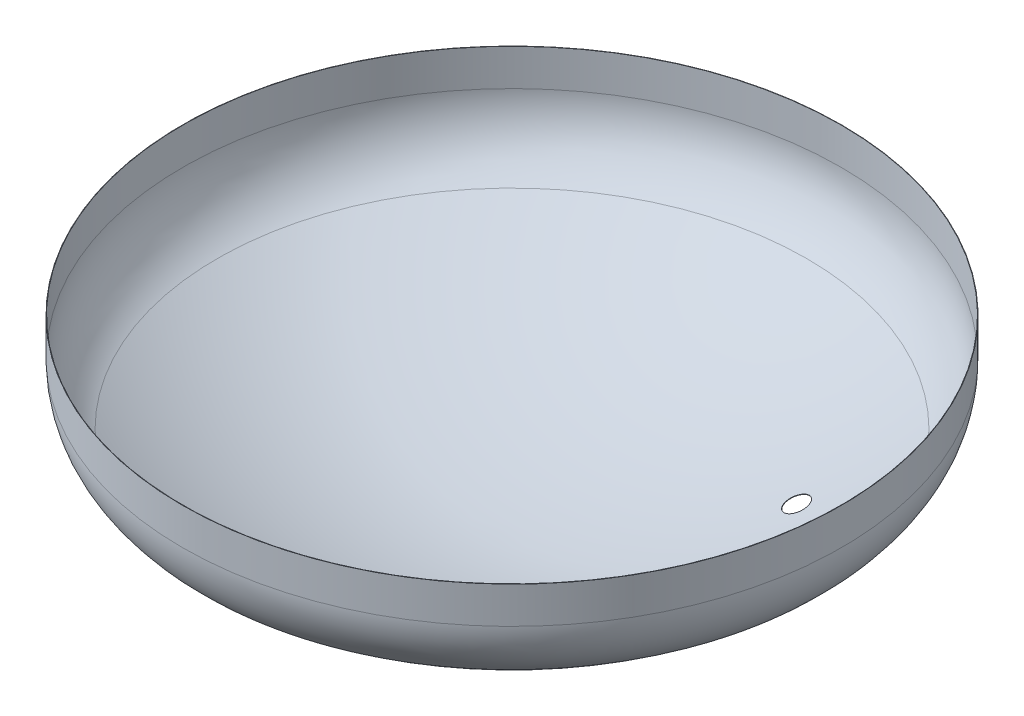
ISO-10303-21;
HEADER;
FILE_DESCRIPTION(('STEP AP214'),'2;1');
FILE_NAME('part.step','',(''),(''),'','','');
FILE_SCHEMA(('AUTOMOTIVE_DESIGN { 1 0 10303 214 1 1 1 1 }'));
ENDSEC;
DATA;
#1=APPLICATION_CONTEXT('core data for automotive mechanical design processes');
#2=APPLICATION_PROTOCOL_DEFINITION('international standard','automotive_design',2000,#1);
#3=PRODUCT_CONTEXT('',#1,'mechanical');
#4=PRODUCT('Part','Part','',(#3));
#5=PRODUCT_RELATED_PRODUCT_CATEGORY('part','',(#4));
#6=PRODUCT_DEFINITION_FORMATION('','',#4);
#7=PRODUCT_DEFINITION_CONTEXT('part definition',#1,'design');
#8=PRODUCT_DEFINITION('design','',#6,#7);
#9=PRODUCT_DEFINITION_SHAPE('','',#8);
#10=(LENGTH_UNIT() NAMED_UNIT(*) SI_UNIT(.MILLI.,.METRE.));
#11=(NAMED_UNIT(*) PLANE_ANGLE_UNIT() SI_UNIT($,.RADIAN.));
#12=(NAMED_UNIT(*) SI_UNIT($,.STERADIAN.) SOLID_ANGLE_UNIT());
#13=UNCERTAINTY_MEASURE_WITH_UNIT(LENGTH_MEASURE(1.E-05),#10,'distance_accuracy_value','');
#14=(GEOMETRIC_REPRESENTATION_CONTEXT(3) GLOBAL_UNCERTAINTY_ASSIGNED_CONTEXT((#13)) GLOBAL_UNIT_ASSIGNED_CONTEXT((#10,
#11,#12)) REPRESENTATION_CONTEXT('',''));
#15=CARTESIAN_POINT('',(0.,0.,0.));
#16=DIRECTION('',(0.,0.,1.));
#17=DIRECTION('',(1.,0.,0.));
#18=AXIS2_PLACEMENT_3D('',#15,#16,#17);
#19=CARTESIAN_POINT('',(0.,2225.,0.));
#20=DIRECTION('',(0.,-1.,0.));
#21=DIRECTION('',(1.,0.,0.));
#22=AXIS2_PLACEMENT_3D('',#19,#20,#21);
#23=SPHERICAL_SURFACE('',#22,1524.);
#24=CARTESIAN_POINT('',(476.976413862682,892.724049239016,564.932997480776));
#25=DIRECTION('',(-0.313041418963689,0.8743777301271,-0.370767656452097));
#26=DIRECTION('',(0.,0.390388802704132,0.920650087016362));
#27=AXIS2_PLACEMENT_3D('',#24,#25,#26);
#28=CIRCLE('',#27,30.9999999999999);
#29=CARTESIAN_POINT('',(476.976413862682,904.826102122845,593.473150178283));
#30=VERTEX_POINT('',#29);
#31=EDGE_CURVE('E115',#30,#30,#28,.T.);
#32=ORIENTED_EDGE('',*,*,#31,.F.);
#33=EDGE_LOOP('',(#32));
#34=FACE_BOUND('',#33,.T.);
#35=CARTESIAN_POINT('',(739.361745713097,892.724049239016,0.));
#36=DIRECTION('',(-0.485245901639344,0.8743777301271,0.));
#37=DIRECTION('',(-0.8743777301271,-0.485245901639344,0.));
#38=AXIS2_PLACEMENT_3D('',#35,#36,#37);
#39=CIRCLE('',#38,30.9999999999999);
#40=CARTESIAN_POINT('',(712.256036079157,877.681426288197,0.));
#41=VERTEX_POINT('',#40);
#42=EDGE_CURVE('E108',#41,#41,#39,.T.);
#43=ORIENTED_EDGE('',*,*,#42,.F.);
#44=EDGE_LOOP('',(#43));
#45=FACE_BOUND('',#44,.T.);
#46=CARTESIAN_POINT('',(441.031015003651,805.802650245905,-336.133197193915));
#47=DIRECTION('',(-0.289450318152389,0.931424572042739,0.220605484783316));
#48=DIRECTION('',(-0.954951597896464,-0.296761597372353,0.));
#49=AXIS2_PLACEMENT_3D('',#46,#47,#48);
#50=CIRCLE('',#49,30.9999999999999);
#51=CARTESIAN_POINT('',(411.427515468861,796.603040727362,-336.133197193915));
#52=VERTEX_POINT('',#51);
#53=EDGE_CURVE('E101',#52,#52,#50,.T.);
#54=ORIENTED_EDGE('',*,*,#53,.F.);
#55=EDGE_LOOP('',(#54));
#56=FACE_BOUND('',#55,.T.);
#57=CARTESIAN_POINT('',(554.521309284823,805.802650245905,0.));
#58=DIRECTION('',(-0.363934426229508,0.931424572042739,0.));
#59=DIRECTION('',(-0.931424572042739,-0.363934426229508,0.));
#60=AXIS2_PLACEMENT_3D('',#57,#58,#59);
#61=CIRCLE('',#60,30.9999999999999);
#62=CARTESIAN_POINT('',(525.647147551498,794.52068303279,0.));
#63=VERTEX_POINT('',#62);
#64=EDGE_CURVE('E94',#63,#63,#61,.T.);
#65=ORIENTED_EDGE('',*,*,#64,.F.);
#66=EDGE_LOOP('',(#65));
#67=FACE_BOUND('',#66,.T.);
#68=CARTESIAN_POINT('',(695.615997398622,892.724049239016,250.547750313266));
#69=DIRECTION('',(-0.456535402067484,0.8743777301271,-0.164435433276591));
#70=DIRECTION('',(-0.886444141805444,-0.462835590095242,0.));
#71=AXIS2_PLACEMENT_3D('',#68,#69,#70);
#72=CIRCLE('',#71,30.9999999999999);
#73=CARTESIAN_POINT('',(668.136229002653,878.376145946064,250.547750313266));
#74=VERTEX_POINT('',#73);
#75=EDGE_CURVE('E86',#74,#74,#72,.T.);
#76=ORIENTED_EDGE('',*,*,#75,.F.);
#77=EDGE_LOOP('',(#76));
#78=FACE_BOUND('',#77,.T.);
#79=CARTESIAN_POINT('',(450.811326739237,805.802650245905,322.897863316813));
#80=DIRECTION('',(-0.295869173623294,0.931424572042739,-0.211919085253005));
#81=DIRECTION('',(-0.953071479298859,-0.302745363873807,0.));
#82=AXIS2_PLACEMENT_3D('',#79,#80,#81);
#83=CIRCLE('',#82,31.);
#84=CARTESIAN_POINT('',(421.266110880972,796.417543965817,322.897863316813));
#85=VERTEX_POINT('',#84);
#86=EDGE_CURVE('E79',#85,#85,#83,.T.);
#87=ORIENTED_EDGE('',*,*,#86,.F.);
#88=EDGE_LOOP('',(#87));
#89=FACE_BOUND('',#88,.T.);
#90=CARTESIAN_POINT('',(691.061644829552,892.724049239016,-262.848994803846));
#91=DIRECTION('',(-0.453546363303205,0.8743777301271,0.172508786420336));
#92=DIRECTION('',(-0.88768593636519,-0.460449430860172,0.));
#93=AXIS2_PLACEMENT_3D('',#90,#91,#92);
#94=CIRCLE('',#93,30.9999999999999);
#95=CARTESIAN_POINT('',(663.543380802231,878.450116882351,-262.848994803846));
#96=VERTEX_POINT('',#95);
#97=EDGE_CURVE('E72',#96,#96,#94,.T.);
#98=ORIENTED_EDGE('',*,*,#97,.F.);
#99=EDGE_LOOP('',(#98));
#100=FACE_BOUND('',#99,.T.);
#101=CARTESIAN_POINT('',(0.,931.037735849056,0.));
#102=DIRECTION('',(0.,-1.,0.));
#103=DIRECTION('',(0.,0.,-1.));
#104=AXIS2_PLACEMENT_3D('',#101,#102,#103);
#105=CIRCLE('',#104,805.132075471697);
#106=CARTESIAN_POINT('',(0.,931.037735849056,-805.132075471697));
#107=VERTEX_POINT('',#106);
#108=EDGE_CURVE('E65',#107,#107,#105,.T.);
#109=ORIENTED_EDGE('',*,*,#108,.F.);
#110=EDGE_LOOP('',(#109));
#111=FACE_BOUND('',#110,.T.);
#112=ADVANCED_FACE('F37',(#34,#45,#56,#67,#78,#89,#100,#111),#23,.F.);
#113=CARTESIAN_POINT('',(0.,2225.,0.));
#114=DIRECTION('',(0.,-1.,0.));
#115=DIRECTION('',(1.,0.,0.));
#116=AXIS2_PLACEMENT_3D('',#113,#114,#115);
#117=SPHERICAL_SURFACE('',#116,1525.);
#118=CARTESIAN_POINT('',(477.289520022003,891.8494906781,565.303841815997));
#119=DIRECTION('',(-0.313041418963689,0.8743777301271,-0.370767656452097));
#120=DIRECTION('',(0.,0.390388802704132,0.920650087016362));
#121=AXIS2_PLACEMENT_3D('',#118,#119,#120);
#122=CIRCLE('',#121,30.9999999999999);
#123=CARTESIAN_POINT('',(477.289520022003,903.951543561928,593.843994513504));
#124=VERTEX_POINT('',#123);
#125=EDGE_CURVE('E112',#124,#124,#122,.T.);
#126=ORIENTED_EDGE('',*,*,#125,.T.);
#127=EDGE_LOOP('',(#126));
#128=FACE_BOUND('',#127,.T.);
#129=CARTESIAN_POINT('',(739.847091968847,891.8494906781,0.));
#130=DIRECTION('',(-0.485245901639344,0.8743777301271,0.));
#131=DIRECTION('',(-0.8743777301271,-0.485245901639344,0.));
#132=AXIS2_PLACEMENT_3D('',#129,#130,#131);
#133=CIRCLE('',#132,30.9999999999999);
#134=CARTESIAN_POINT('',(712.741382334907,876.80686772728,0.));
#135=VERTEX_POINT('',#134);
#136=EDGE_CURVE('E104',#135,#135,#133,.T.);
#137=ORIENTED_EDGE('',*,*,#136,.T.);
#138=EDGE_LOOP('',(#137));
#139=FACE_BOUND('',#138,.T.);
#140=CARTESIAN_POINT('',(441.320525183266,804.871033045168,-336.353848302303));
#141=DIRECTION('',(-0.289450318152389,0.931424572042739,0.220605484783316));
#142=DIRECTION('',(-0.954951597896464,-0.296761597372353,0.));
#143=AXIS2_PLACEMENT_3D('',#140,#141,#142);
#144=CIRCLE('',#143,30.9999999999999);
#145=CARTESIAN_POINT('',(411.717025648475,795.671423526625,-336.353848302303));
#146=VERTEX_POINT('',#145);
#147=EDGE_CURVE('E98',#146,#146,#144,.T.);
#148=ORIENTED_EDGE('',*,*,#147,.T.);
#149=EDGE_LOOP('',(#148));
#150=FACE_BOUND('',#149,.T.);
#151=CARTESIAN_POINT('',(554.885318976635,804.871033045168,0.));
#152=DIRECTION('',(-0.363934426229508,0.931424572042739,0.));
#153=DIRECTION('',(-0.931424572042739,-0.363934426229508,0.));
#154=AXIS2_PLACEMENT_3D('',#151,#152,#153);
#155=CIRCLE('',#154,30.9999999999999);
#156=CARTESIAN_POINT('',(526.01115724331,793.589065832053,0.));
#157=VERTEX_POINT('',#156);
#158=EDGE_CURVE('E90',#157,#157,#155,.T.);
#159=ORIENTED_EDGE('',*,*,#158,.T.);
#160=EDGE_LOOP('',(#159));
#161=FACE_BOUND('',#160,.T.);
#162=CARTESIAN_POINT('',(696.072627217158,891.8494906781,250.712219753572));
#163=DIRECTION('',(-0.456535402067484,0.8743777301271,-0.164435433276591));
#164=DIRECTION('',(-0.886444141805444,-0.462835590095242,0.));
#165=AXIS2_PLACEMENT_3D('',#162,#163,#164);
#166=CIRCLE('',#165,30.9999999999999);
#167=CARTESIAN_POINT('',(668.592858821189,877.501587385148,250.712219753572));
#168=VERTEX_POINT('',#167);
#169=EDGE_CURVE('E82',#168,#168,#166,.T.);
#170=ORIENTED_EDGE('',*,*,#169,.T.);
#171=EDGE_LOOP('',(#170));
#172=FACE_BOUND('',#171,.T.);
#173=CARTESIAN_POINT('',(451.107257101811,804.871033045168,323.109826229229));
#174=DIRECTION('',(-0.295869173623294,0.931424572042739,-0.211919085253005));
#175=DIRECTION('',(-0.953071479298859,-0.302745363873807,0.));
#176=AXIS2_PLACEMENT_3D('',#173,#174,#175);
#177=CIRCLE('',#176,31.);
#178=CARTESIAN_POINT('',(421.562041243546,795.48592676508,323.109826229229));
#179=VERTEX_POINT('',#178);
#180=EDGE_CURVE('E76',#179,#179,#177,.T.);
#181=ORIENTED_EDGE('',*,*,#180,.T.);
#182=EDGE_LOOP('',(#181));
#183=FACE_BOUND('',#182,.T.);
#184=CARTESIAN_POINT('',(691.515284991158,891.8494906781,-263.021539266953));
#185=DIRECTION('',(-0.453546363303205,0.8743777301271,0.172508786420336));
#186=DIRECTION('',(-0.88768593636519,-0.460449430860172,0.));
#187=AXIS2_PLACEMENT_3D('',#184,#185,#186);
#188=CIRCLE('',#187,30.9999999999999);
#189=CARTESIAN_POINT('',(663.997020963837,877.575558321435,-263.021539266953));
#190=VERTEX_POINT('',#189);
#191=EDGE_CURVE('E68',#190,#190,#188,.T.);
#192=ORIENTED_EDGE('',*,*,#191,.T.);
#193=EDGE_LOOP('',(#192));
#194=FACE_BOUND('',#193,.T.);
#195=CARTESIAN_POINT('',(0.,930.18867924528,0.));
#196=DIRECTION('',(0.,-1.,0.));
#197=DIRECTION('',(0.,0.,-1.));
#198=AXIS2_PLACEMENT_3D('',#195,#196,#197);
#199=CIRCLE('',#198,805.660377358492);
#200=CARTESIAN_POINT('',(0.,930.18867924528,-805.660377358492));
#201=VERTEX_POINT('',#200);
#202=EDGE_CURVE('E10',#201,#201,#199,.T.);
#203=ORIENTED_EDGE('',*,*,#202,.T.);
#204=EDGE_LOOP('',(#203));
#205=FACE_BOUND('',#204,.T.);
#206=ADVANCED_FACE('F124',(#128,#139,#150,#161,#172,#183,#194,#205),#117,.T.);
#207=CARTESIAN_POINT('',(0.,1100.,0.));
#208=DIRECTION('',(0.,-1.,0.));
#209=DIRECTION('',(0.,0.,-1.));
#210=AXIS2_PLACEMENT_3D('',#207,#208,#209);
#211=TOROIDAL_SURFACE('',#210,700.,200.000000000003);
#212=ORIENTED_EDGE('',*,*,#202,.F.);
#213=EDGE_LOOP('',(#212));
#214=FACE_BOUND('',#213,.T.);
#215=CARTESIAN_POINT('',(0.,1100.,0.));
#216=DIRECTION('',(0.,-1.,0.));
#217=DIRECTION('',(0.,0.,-1.));
#218=AXIS2_PLACEMENT_3D('',#215,#216,#217);
#219=CIRCLE('',#218,900.000000000006);
#220=CARTESIAN_POINT('',(0.,1100.,-900.000000000006));
#221=VERTEX_POINT('',#220);
#222=EDGE_CURVE('E44',#221,#221,#219,.T.);
#223=ORIENTED_EDGE('',*,*,#222,.T.);
#224=EDGE_LOOP('',(#223));
#225=FACE_BOUND('',#224,.T.);
#226=ADVANCED_FACE('F160',(#214,#225),#211,.T.);
#227=CARTESIAN_POINT('',(0.,0.,0.));
#228=DIRECTION('',(0.,-1.,0.));
#229=DIRECTION('',(0.,0.,-1.));
#230=AXIS2_PLACEMENT_3D('',#227,#228,#229);
#231=CYLINDRICAL_SURFACE('',#230,900.000000000003);
#232=ORIENTED_EDGE('',*,*,#222,.F.);
#233=EDGE_LOOP('',(#232));
#234=FACE_BOUND('',#233,.T.);
#235=CARTESIAN_POINT('',(0.,1200.,0.));
#236=DIRECTION('',(0.,-1.,0.));
#237=DIRECTION('',(0.,0.,-1.));
#238=AXIS2_PLACEMENT_3D('',#235,#236,#237);
#239=CIRCLE('',#238,900.);
#240=CARTESIAN_POINT('',(0.,1200.,-900.));
#241=VERTEX_POINT('',#240);
#242=EDGE_CURVE('E50',#241,#241,#239,.T.);
#243=ORIENTED_EDGE('',*,*,#242,.T.);
#244=EDGE_LOOP('',(#243));
#245=FACE_BOUND('',#244,.T.);
#246=ADVANCED_FACE('F154',(#234,#245),#231,.T.);
#247=CARTESIAN_POINT('',(899.,1200.,0.));
#248=DIRECTION('',(0.,-1.,0.));
#249=DIRECTION('',(0.,0.,-1.));
#250=AXIS2_PLACEMENT_3D('',#247,#248,#249);
#251=PLANE('',#250);
#252=ORIENTED_EDGE('',*,*,#242,.F.);
#253=EDGE_LOOP('',(#252));
#254=FACE_BOUND('',#253,.T.);
#255=CARTESIAN_POINT('',(0.,1200.,0.));
#256=DIRECTION('',(0.,-1.,0.));
#257=DIRECTION('',(0.,0.,-1.));
#258=AXIS2_PLACEMENT_3D('',#255,#256,#257);
#259=CIRCLE('',#258,899.);
#260=CARTESIAN_POINT('',(0.,1200.,-899.));
#261=VERTEX_POINT('',#260);
#262=EDGE_CURVE('E57',#261,#261,#259,.T.);
#263=ORIENTED_EDGE('',*,*,#262,.T.);
#264=EDGE_LOOP('',(#263));
#265=FACE_BOUND('',#264,.T.);
#266=ADVANCED_FACE('F149',(#254,#265),#251,.F.);
#267=CARTESIAN_POINT('',(0.,0.,0.));
#268=DIRECTION('',(0.,-1.,0.));
#269=DIRECTION('',(0.,0.,-1.));
#270=AXIS2_PLACEMENT_3D('',#267,#268,#269);
#271=CYLINDRICAL_SURFACE('',#270,899.000000000001);
#272=CARTESIAN_POINT('',(0.,1100.,0.));
#273=DIRECTION('',(0.,-1.,0.));
#274=DIRECTION('',(0.,0.,-1.));
#275=AXIS2_PLACEMENT_3D('',#272,#273,#274);
#276=CIRCLE('',#275,899.000000000003);
#277=CARTESIAN_POINT('',(0.,1100.,-899.000000000003));
#278=VERTEX_POINT('',#277);
#279=EDGE_CURVE('E62',#278,#278,#276,.T.);
#280=ORIENTED_EDGE('',*,*,#279,.T.);
#281=EDGE_LOOP('',(#280));
#282=FACE_BOUND('',#281,.T.);
#283=ORIENTED_EDGE('',*,*,#262,.F.);
#284=EDGE_LOOP('',(#283));
#285=FACE_BOUND('',#284,.T.);
#286=ADVANCED_FACE('F143',(#282,#285),#271,.F.);
#287=CARTESIAN_POINT('',(0.,1100.,0.));
#288=DIRECTION('',(0.,-1.,0.));
#289=DIRECTION('',(0.,0.,-1.));
#290=AXIS2_PLACEMENT_3D('',#287,#288,#289);
#291=TOROIDAL_SURFACE('',#290,700.,199.000000000003);
#292=ORIENTED_EDGE('',*,*,#108,.T.);
#293=EDGE_LOOP('',(#292));
#294=FACE_BOUND('',#293,.T.);
#295=ORIENTED_EDGE('',*,*,#279,.F.);
#296=EDGE_LOOP('',(#295));
#297=FACE_BOUND('',#296,.T.);
#298=ADVANCED_FACE('F139',(#294,#297),#291,.F.);
#299=CARTESIAN_POINT('',(691.658204037388,891.573961556172,-263.075899291013));
#300=DIRECTION('',(0.453546363303205,-0.8743777301271,-0.172508786420336));
#301=DIRECTION('',(0.88768593636519,0.460449430860172,0.));
#302=AXIS2_PLACEMENT_3D('',#299,#300,#301);
#303=CYLINDRICAL_SURFACE('',#302,30.9999999999999);
#304=ORIENTED_EDGE('',*,*,#97,.T.);
#305=EDGE_LOOP('',(#304));
#306=FACE_BOUND('',#305,.T.);
#307=ORIENTED_EDGE('',*,*,#191,.F.);
#308=EDGE_LOOP('',(#307));
#309=FACE_BOUND('',#308,.T.);
#310=ADVANCED_FACE('F142',(#306,#309),#303,.F.);
#311=CARTESIAN_POINT('',(451.200489775523,804.577527634823,323.176605010833));
#312=DIRECTION('',(0.295869173623294,-0.931424572042739,0.211919085253005));
#313=DIRECTION('',(0.953071479298859,0.302745363873807,0.));
#314=AXIS2_PLACEMENT_3D('',#311,#312,#313);
#315=CYLINDRICAL_SURFACE('',#314,31.);
#316=ORIENTED_EDGE('',*,*,#86,.T.);
#317=EDGE_LOOP('',(#316));
#318=FACE_BOUND('',#317,.T.);
#319=ORIENTED_EDGE('',*,*,#180,.F.);
#320=EDGE_LOOP('',(#319));
#321=FACE_BOUND('',#320,.T.);
#322=ADVANCED_FACE('F186',(#318,#321),#315,.F.);
#323=CARTESIAN_POINT('',(696.216488152914,891.573961556172,250.764035746802));
#324=DIRECTION('',(0.456535402067484,-0.8743777301271,0.164435433276591));
#325=DIRECTION('',(0.886444141805444,0.462835590095242,0.));
#326=AXIS2_PLACEMENT_3D('',#323,#324,#325);
#327=CYLINDRICAL_SURFACE('',#326,30.9999999999999);
#328=ORIENTED_EDGE('',*,*,#75,.T.);
#329=EDGE_LOOP('',(#328));
#330=FACE_BOUND('',#329,.T.);
#331=ORIENTED_EDGE('',*,*,#169,.F.);
#332=EDGE_LOOP('',(#331));
#333=FACE_BOUND('',#332,.T.);
#334=ADVANCED_FACE('F192',(#330,#333),#327,.F.);
#335=CARTESIAN_POINT('',(555.,804.577527634823,0.));
#336=DIRECTION('',(0.363934426229508,-0.931424572042739,0.));
#337=DIRECTION('',(0.931424572042739,0.363934426229508,0.));
#338=AXIS2_PLACEMENT_3D('',#335,#336,#337);
#339=CYLINDRICAL_SURFACE('',#338,30.9999999999999);
#340=ORIENTED_EDGE('',*,*,#64,.T.);
#341=EDGE_LOOP('',(#340));
#342=FACE_BOUND('',#341,.T.);
#343=ORIENTED_EDGE('',*,*,#158,.F.);
#344=EDGE_LOOP('',(#343));
#345=FACE_BOUND('',#344,.T.);
#346=ADVANCED_FACE('F198',(#342,#345),#339,.F.);
#347=CARTESIAN_POINT('',(441.411735182394,804.577527634823,-336.423364294557));
#348=DIRECTION('',(0.289450318152389,-0.931424572042739,-0.220605484783316));
#349=DIRECTION('',(0.954951597896464,0.296761597372353,0.));
#350=AXIS2_PLACEMENT_3D('',#347,#348,#349);
#351=CYLINDRICAL_SURFACE('',#350,30.9999999999999);
#352=ORIENTED_EDGE('',*,*,#53,.T.);
#353=EDGE_LOOP('',(#352));
#354=FACE_BOUND('',#353,.T.);
#355=ORIENTED_EDGE('',*,*,#147,.F.);
#356=EDGE_LOOP('',(#355));
#357=FACE_BOUND('',#356,.T.);
#358=ADVANCED_FACE('F202',(#354,#357),#351,.F.);
#359=CARTESIAN_POINT('',(740.,891.573961556172,0.));
#360=DIRECTION('',(0.485245901639344,-0.8743777301271,0.));
#361=DIRECTION('',(0.8743777301271,0.485245901639344,0.));
#362=AXIS2_PLACEMENT_3D('',#359,#360,#361);
#363=CYLINDRICAL_SURFACE('',#362,30.9999999999999);
#364=ORIENTED_EDGE('',*,*,#42,.T.);
#365=EDGE_LOOP('',(#364));
#366=FACE_BOUND('',#365,.T.);
#367=ORIENTED_EDGE('',*,*,#136,.F.);
#368=EDGE_LOOP('',(#367));
#369=FACE_BOUND('',#368,.T.);
#370=ADVANCED_FACE('F206',(#366,#369),#363,.F.);
#371=CARTESIAN_POINT('',(477.388163919625,891.573961556172,565.420676089448));
#372=DIRECTION('',(0.313041418963689,-0.8743777301271,0.370767656452097));
#373=DIRECTION('',(0.,-0.390388802704132,-0.920650087016362));
#374=AXIS2_PLACEMENT_3D('',#371,#372,#373);
#375=CYLINDRICAL_SURFACE('',#374,30.9999999999999);
#376=ORIENTED_EDGE('',*,*,#31,.T.);
#377=EDGE_LOOP('',(#376));
#378=FACE_BOUND('',#377,.T.);
#379=ORIENTED_EDGE('',*,*,#125,.F.);
#380=EDGE_LOOP('',(#379));
#381=FACE_BOUND('',#380,.T.);
#382=ADVANCED_FACE('F119',(#378,#381),#375,.F.);
#383=CLOSED_SHELL('',(#112,#206,#226,#246,#266,#286,#298,#310,#322,#334,#346,#358,#370,#382));
#384=MANIFOLD_SOLID_BREP('B2',#383);
#385=ADVANCED_BREP_SHAPE_REPRESENTATION('',(#18,#384),#14);
#386=SHAPE_DEFINITION_REPRESENTATION(#9,#385);
ENDSEC;
END-ISO-10303-21;
